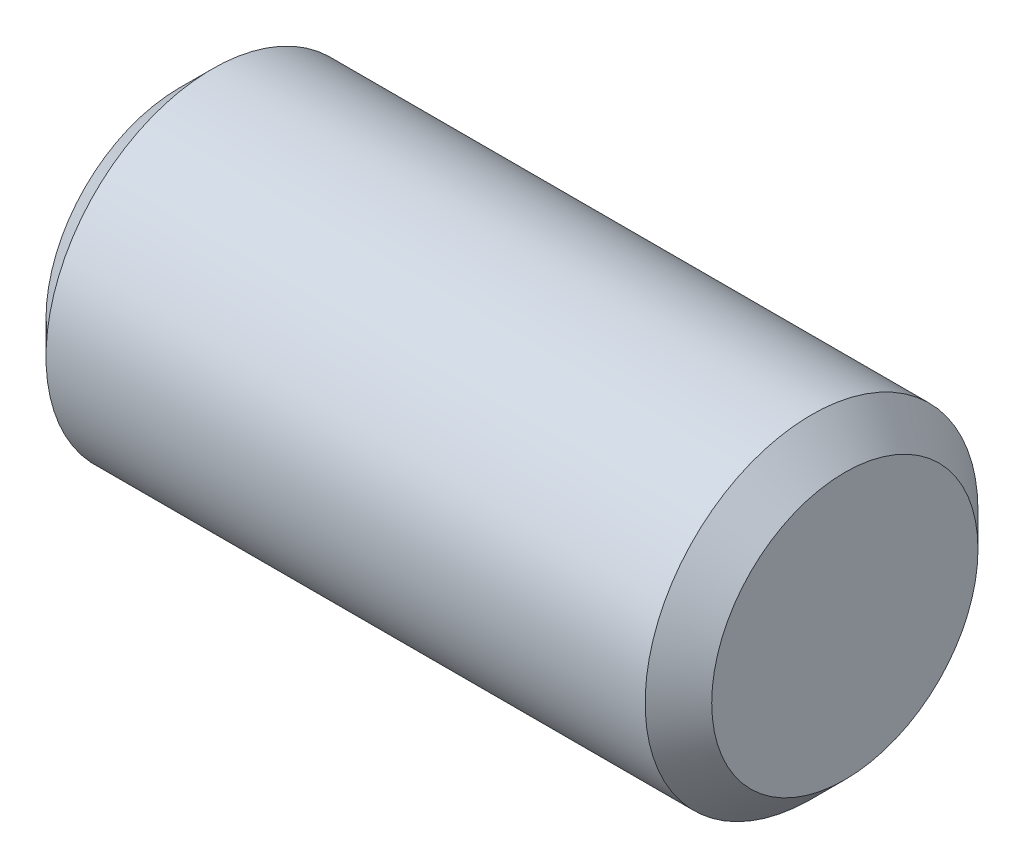
ISO-10303-21;
HEADER;
FILE_DESCRIPTION(('STEP AP214'),'2;1');
FILE_NAME('part.step','',(''),(''),'','','');
FILE_SCHEMA(('AUTOMOTIVE_DESIGN { 1 0 10303 214 1 1 1 1 }'));
ENDSEC;
DATA;
#1=APPLICATION_CONTEXT('core data for automotive mechanical design processes');
#2=APPLICATION_PROTOCOL_DEFINITION('international standard','automotive_design',2000,#1);
#3=PRODUCT_CONTEXT('',#1,'mechanical');
#4=PRODUCT('Part','Part','',(#3));
#5=PRODUCT_RELATED_PRODUCT_CATEGORY('part','',(#4));
#6=PRODUCT_DEFINITION_FORMATION('','',#4);
#7=PRODUCT_DEFINITION_CONTEXT('part definition',#1,'design');
#8=PRODUCT_DEFINITION('design','',#6,#7);
#9=PRODUCT_DEFINITION_SHAPE('','',#8);
#10=(LENGTH_UNIT() NAMED_UNIT(*) SI_UNIT(.MILLI.,.METRE.));
#11=(NAMED_UNIT(*) PLANE_ANGLE_UNIT() SI_UNIT($,.RADIAN.));
#12=(NAMED_UNIT(*) SI_UNIT($,.STERADIAN.) SOLID_ANGLE_UNIT());
#13=UNCERTAINTY_MEASURE_WITH_UNIT(LENGTH_MEASURE(1.E-05),#10,'distance_accuracy_value','');
#14=(GEOMETRIC_REPRESENTATION_CONTEXT(3) GLOBAL_UNCERTAINTY_ASSIGNED_CONTEXT((#13)) GLOBAL_UNIT_ASSIGNED_CONTEXT((#10,
#11,#12)) REPRESENTATION_CONTEXT('',''));
#15=CARTESIAN_POINT('',(0.,0.,0.));
#16=DIRECTION('',(0.,0.,1.));
#17=DIRECTION('',(1.,0.,0.));
#18=AXIS2_PLACEMENT_3D('',#15,#16,#17);
#19=CARTESIAN_POINT('',(-4.7625,0.,0.));
#20=DIRECTION('',(1.,0.,0.));
#21=DIRECTION('',(0.,0.,-1.));
#22=AXIS2_PLACEMENT_3D('',#19,#20,#21);
#23=CYLINDRICAL_SURFACE('',#22,2.38125);
#24=CARTESIAN_POINT('',(4.28625,0.,0.));
#25=DIRECTION('',(1.,0.,0.));
#26=DIRECTION('',(0.,0.,-1.));
#27=AXIS2_PLACEMENT_3D('',#24,#25,#26);
#28=CIRCLE('',#27,2.38125);
#29=CARTESIAN_POINT('',(4.28625,0.,-2.38125));
#30=VERTEX_POINT('',#29);
#31=EDGE_CURVE('E37',#30,#30,#28,.F.);
#32=ORIENTED_EDGE('',*,*,#31,.T.);
#33=EDGE_LOOP('',(#32));
#34=FACE_BOUND('',#33,.T.);
#35=CARTESIAN_POINT('',(-4.28625000000001,0.,0.));
#36=DIRECTION('',(1.,0.,0.));
#37=DIRECTION('',(0.,0.,-1.));
#38=AXIS2_PLACEMENT_3D('',#35,#36,#37);
#39=CIRCLE('',#38,2.38125);
#40=CARTESIAN_POINT('',(-4.28625000000001,0.,-2.38125));
#41=VERTEX_POINT('',#40);
#42=EDGE_CURVE('E41',#41,#41,#39,.T.);
#43=ORIENTED_EDGE('',*,*,#42,.T.);
#44=EDGE_LOOP('',(#43));
#45=FACE_BOUND('',#44,.T.);
#46=ADVANCED_FACE('F30',(#34,#45),#23,.T.);
#47=CARTESIAN_POINT('',(-4.7625,0.,0.));
#48=DIRECTION('',(1.,0.,0.));
#49=DIRECTION('',(0.,0.,-1.));
#50=AXIS2_PLACEMENT_3D('',#47,#48,#49);
#51=PLANE('',#50);
#52=CARTESIAN_POINT('',(-4.7625,0.,0.));
#53=DIRECTION('',(1.,0.,0.));
#54=DIRECTION('',(0.,0.,-1.));
#55=AXIS2_PLACEMENT_3D('',#52,#53,#54);
#56=CIRCLE('',#55,1.905);
#57=CARTESIAN_POINT('',(-4.7625,0.,-1.905));
#58=VERTEX_POINT('',#57);
#59=EDGE_CURVE('E10',#58,#58,#56,.F.);
#60=ORIENTED_EDGE('',*,*,#59,.T.);
#61=EDGE_LOOP('',(#60));
#62=FACE_BOUND('',#61,.T.);
#63=ADVANCED_FACE('F61',(#62),#51,.F.);
#64=CARTESIAN_POINT('',(4.7625,0.,0.));
#65=DIRECTION('',(1.,0.,0.));
#66=DIRECTION('',(0.,0.,-1.));
#67=AXIS2_PLACEMENT_3D('',#64,#65,#66);
#68=PLANE('',#67);
#69=CARTESIAN_POINT('',(4.7625,0.,0.));
#70=DIRECTION('',(1.,0.,0.));
#71=DIRECTION('',(0.,0.,-1.));
#72=AXIS2_PLACEMENT_3D('',#69,#70,#71);
#73=CIRCLE('',#72,1.905);
#74=CARTESIAN_POINT('',(4.7625,0.,-1.905));
#75=VERTEX_POINT('',#74);
#76=EDGE_CURVE('E45',#75,#75,#73,.T.);
#77=ORIENTED_EDGE('',*,*,#76,.T.);
#78=EDGE_LOOP('',(#77));
#79=FACE_BOUND('',#78,.T.);
#80=ADVANCED_FACE('F51',(#79),#68,.T.);
#81=CARTESIAN_POINT('',(4.7625,0.,0.));
#82=DIRECTION('',(-1.,0.,0.));
#83=DIRECTION('',(0.,0.,1.));
#84=AXIS2_PLACEMENT_3D('',#81,#82,#83);
#85=CONICAL_SURFACE('',#84,1.905,0.785398163397445);
#86=ORIENTED_EDGE('',*,*,#31,.F.);
#87=EDGE_LOOP('',(#86));
#88=FACE_BOUND('',#87,.T.);
#89=ORIENTED_EDGE('',*,*,#76,.F.);
#90=EDGE_LOOP('',(#89));
#91=FACE_BOUND('',#90,.T.);
#92=ADVANCED_FACE('F53',(#88,#91),#85,.T.);
#93=CARTESIAN_POINT('',(-4.28625000000001,0.,0.));
#94=DIRECTION('',(1.,0.,0.));
#95=DIRECTION('',(0.,0.,-1.));
#96=AXIS2_PLACEMENT_3D('',#93,#94,#95);
#97=CONICAL_SURFACE('',#96,2.38125,0.785398163397451);
#98=ORIENTED_EDGE('',*,*,#59,.F.);
#99=EDGE_LOOP('',(#98));
#100=FACE_BOUND('',#99,.T.);
#101=ORIENTED_EDGE('',*,*,#42,.F.);
#102=EDGE_LOOP('',(#101));
#103=FACE_BOUND('',#102,.T.);
#104=ADVANCED_FACE('F32',(#100,#103),#97,.T.);
#105=CLOSED_SHELL('',(#46,#63,#80,#92,#104));
#106=MANIFOLD_SOLID_BREP('B2',#105);
#107=ADVANCED_BREP_SHAPE_REPRESENTATION('',(#18,#106),#14);
#108=SHAPE_DEFINITION_REPRESENTATION(#9,#107);
ENDSEC;
END-ISO-10303-21;
